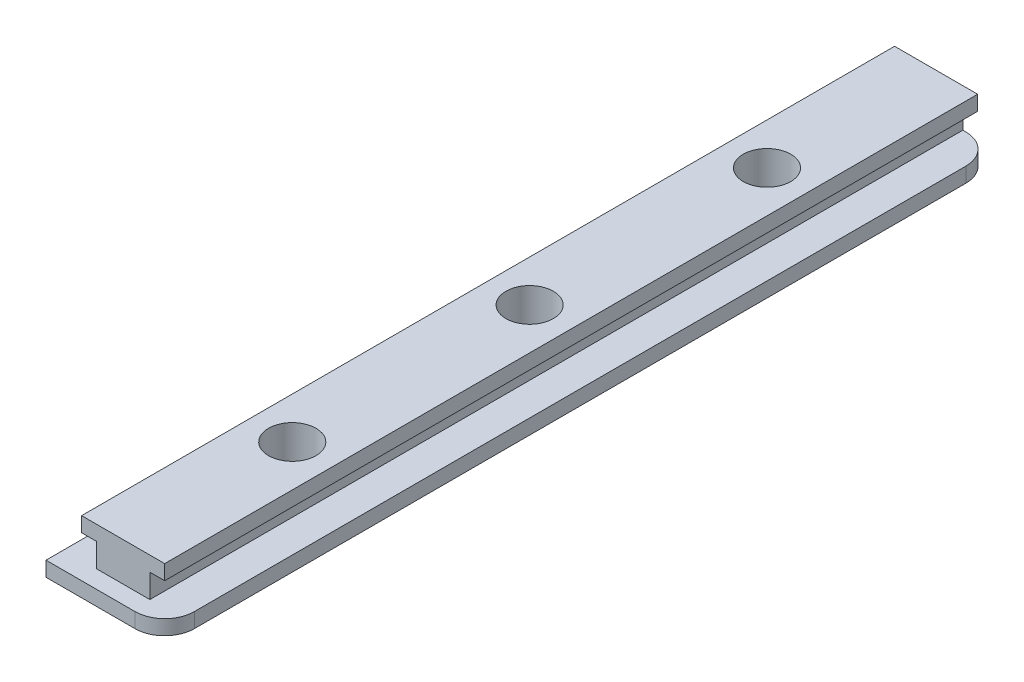
ISO-10303-21;
HEADER;
FILE_DESCRIPTION(('STEP AP214'),'2;1');
FILE_NAME('part.step','',(''),(''),'','','');
FILE_SCHEMA(('AUTOMOTIVE_DESIGN { 1 0 10303 214 1 1 1 1 }'));
ENDSEC;
DATA;
#1=APPLICATION_CONTEXT('core data for automotive mechanical design processes');
#2=APPLICATION_PROTOCOL_DEFINITION('international standard','automotive_design',2000,#1);
#3=PRODUCT_CONTEXT('',#1,'mechanical');
#4=PRODUCT('Part','Part','',(#3));
#5=PRODUCT_RELATED_PRODUCT_CATEGORY('part','',(#4));
#6=PRODUCT_DEFINITION_FORMATION('','',#4);
#7=PRODUCT_DEFINITION_CONTEXT('part definition',#1,'design');
#8=PRODUCT_DEFINITION('design','',#6,#7);
#9=PRODUCT_DEFINITION_SHAPE('','',#8);
#10=(LENGTH_UNIT() NAMED_UNIT(*) SI_UNIT(.MILLI.,.METRE.));
#11=(NAMED_UNIT(*) PLANE_ANGLE_UNIT() SI_UNIT($,.RADIAN.));
#12=(NAMED_UNIT(*) SI_UNIT($,.STERADIAN.) SOLID_ANGLE_UNIT());
#13=UNCERTAINTY_MEASURE_WITH_UNIT(LENGTH_MEASURE(1.E-05),#10,'distance_accuracy_value','');
#14=(GEOMETRIC_REPRESENTATION_CONTEXT(3) GLOBAL_UNCERTAINTY_ASSIGNED_CONTEXT((#13)) GLOBAL_UNIT_ASSIGNED_CONTEXT((#10,
#11,#12)) REPRESENTATION_CONTEXT('',''));
#15=CARTESIAN_POINT('',(0.,0.,0.));
#16=DIRECTION('',(0.,0.,1.));
#17=DIRECTION('',(1.,0.,0.));
#18=AXIS2_PLACEMENT_3D('',#15,#16,#17);
#19=CARTESIAN_POINT('',(-10.,-2.,68.5));
#20=DIRECTION('',(1.,0.,0.));
#21=DIRECTION('',(0.,1.,0.));
#22=AXIS2_PLACEMENT_3D('',#19,#20,#21);
#23=PLANE('',#22);
#24=DIRECTION('',(0.,-1.,0.));
#25=VECTOR('',#24,1.);
#26=CARTESIAN_POINT('',(-10.,-2.,-68.5));
#27=LINE('',#26,#25);
#28=CARTESIAN_POINT('',(-10.,-2.,-68.5));
#29=VERTEX_POINT('',#28);
#30=CARTESIAN_POINT('',(-10.,-4.5,-68.5));
#31=VERTEX_POINT('',#30);
#32=EDGE_CURVE('E142',#29,#31,#27,.T.);
#33=ORIENTED_EDGE('',*,*,#32,.T.);
#34=DIRECTION('',(0.,0.,-1.));
#35=VECTOR('',#34,1.);
#36=CARTESIAN_POINT('',(-10.,-4.5,68.5));
#37=LINE('',#36,#35);
#38=CARTESIAN_POINT('',(-10.,-4.49999999999999,71.5));
#39=VERTEX_POINT('',#38);
#40=EDGE_CURVE('E137',#39,#31,#37,.T.);
#41=ORIENTED_EDGE('',*,*,#40,.F.);
#42=DIRECTION('',(0.,-1.,0.));
#43=VECTOR('',#42,1.);
#44=CARTESIAN_POINT('',(-10.,-2.,71.5));
#45=LINE('',#44,#43);
#46=CARTESIAN_POINT('',(-10.,-2.,71.5));
#47=VERTEX_POINT('',#46);
#48=EDGE_CURVE('E140',#47,#39,#45,.T.);
#49=ORIENTED_EDGE('',*,*,#48,.F.);
#50=DIRECTION('',(0.,0.,-1.));
#51=VECTOR('',#50,1.);
#52=CARTESIAN_POINT('',(-10.,-2.,68.5));
#53=LINE('',#52,#51);
#54=EDGE_CURVE('E205',#47,#29,#53,.T.);
#55=ORIENTED_EDGE('',*,*,#54,.T.);
#56=EDGE_LOOP('',(#33,#41,#49,#55));
#57=FACE_BOUND('',#56,.T.);
#58=ADVANCED_FACE('F32',(#57),#23,.F.);
#59=CARTESIAN_POINT('',(-10.,-4.5,68.5));
#60=DIRECTION('',(0.,1.,0.));
#61=DIRECTION('',(-1.,0.,0.));
#62=AXIS2_PLACEMENT_3D('',#59,#60,#61);
#63=PLANE('',#62);
#64=CARTESIAN_POINT('',(0.,-4.5,-40.));
#65=DIRECTION('',(0.,1.,0.));
#66=DIRECTION('',(-1.,0.,0.));
#67=AXIS2_PLACEMENT_3D('',#64,#65,#66);
#68=CIRCLE('',#67,2.5);
#69=CARTESIAN_POINT('',(-2.5,-4.5,-40.));
#70=VERTEX_POINT('',#69);
#71=EDGE_CURVE('E184',#70,#70,#68,.T.);
#72=ORIENTED_EDGE('',*,*,#71,.T.);
#73=EDGE_LOOP('',(#72));
#74=FACE_BOUND('',#73,.T.);
#75=CARTESIAN_POINT('',(0.,-4.5,0.));
#76=DIRECTION('',(0.,1.,0.));
#77=DIRECTION('',(-1.,0.,0.));
#78=AXIS2_PLACEMENT_3D('',#75,#76,#77);
#79=CIRCLE('',#78,2.5);
#80=CARTESIAN_POINT('',(-2.5,-4.5,0.));
#81=VERTEX_POINT('',#80);
#82=EDGE_CURVE('E258',#81,#81,#79,.T.);
#83=ORIENTED_EDGE('',*,*,#82,.T.);
#84=EDGE_LOOP('',(#83));
#85=FACE_BOUND('',#84,.T.);
#86=CARTESIAN_POINT('',(0.,-4.5,40.));
#87=DIRECTION('',(0.,1.,0.));
#88=DIRECTION('',(-1.,0.,0.));
#89=AXIS2_PLACEMENT_3D('',#86,#87,#88);
#90=CIRCLE('',#89,2.5);
#91=CARTESIAN_POINT('',(-2.5,-4.5,40.));
#92=VERTEX_POINT('',#91);
#93=EDGE_CURVE('E165',#92,#92,#90,.T.);
#94=ORIENTED_EDGE('',*,*,#93,.T.);
#95=EDGE_LOOP('',(#94));
#96=FACE_BOUND('',#95,.T.);
#97=DIRECTION('',(1.,0.,0.));
#98=VECTOR('',#97,1.);
#99=CARTESIAN_POINT('',(-10.,-4.5,-68.5));
#100=LINE('',#99,#98);
#101=CARTESIAN_POINT('',(5.,-4.49999999999999,-68.5));
#102=VERTEX_POINT('',#101);
#103=EDGE_CURVE('E207',#31,#102,#100,.T.);
#104=ORIENTED_EDGE('',*,*,#103,.T.);
#105=CARTESIAN_POINT('',(5.,-4.49999999999999,-63.5));
#106=DIRECTION('',(0.,1.,0.));
#107=DIRECTION('',(-1.,0.,0.));
#108=AXIS2_PLACEMENT_3D('',#105,#106,#107);
#109=CIRCLE('',#108,5.);
#110=CARTESIAN_POINT('',(10.,-4.49999999999999,-63.5));
#111=VERTEX_POINT('',#110);
#112=EDGE_CURVE('E40',#102,#111,#109,.F.);
#113=ORIENTED_EDGE('',*,*,#112,.T.);
#114=DIRECTION('',(0.,0.,-1.));
#115=VECTOR('',#114,1.);
#116=CARTESIAN_POINT('',(10.,-4.49999999999999,68.5));
#117=LINE('',#116,#115);
#118=CARTESIAN_POINT('',(10.,-4.49999999999999,66.5));
#119=VERTEX_POINT('',#118);
#120=EDGE_CURVE('E144',#119,#111,#117,.T.);
#121=ORIENTED_EDGE('',*,*,#120,.F.);
#122=CARTESIAN_POINT('',(5.,-4.49999999999999,66.5));
#123=DIRECTION('',(0.,1.,0.));
#124=DIRECTION('',(-1.,0.,0.));
#125=AXIS2_PLACEMENT_3D('',#122,#123,#124);
#126=CIRCLE('',#125,5.);
#127=CARTESIAN_POINT('',(5.,-4.49999999999999,71.5));
#128=VERTEX_POINT('',#127);
#129=EDGE_CURVE('E47',#119,#128,#126,.F.);
#130=ORIENTED_EDGE('',*,*,#129,.T.);
#131=DIRECTION('',(1.,0.,0.));
#132=VECTOR('',#131,1.);
#133=CARTESIAN_POINT('',(-10.,-4.49999999999999,71.5));
#134=LINE('',#133,#132);
#135=EDGE_CURVE('E146',#39,#128,#134,.T.);
#136=ORIENTED_EDGE('',*,*,#135,.F.);
#137=ORIENTED_EDGE('',*,*,#40,.T.);
#138=EDGE_LOOP('',(#104,#113,#121,#130,#136,#137));
#139=FACE_BOUND('',#138,.T.);
#140=ADVANCED_FACE('F147',(#74,#85,#96,#139),#63,.F.);
#141=CARTESIAN_POINT('',(10.,-2.,68.5));
#142=DIRECTION('',(-1.,0.,0.));
#143=DIRECTION('',(0.,-1.,0.));
#144=AXIS2_PLACEMENT_3D('',#141,#142,#143);
#145=PLANE('',#144);
#146=ORIENTED_EDGE('',*,*,#120,.T.);
#147=DIRECTION('',(0.,1.,0.));
#148=VECTOR('',#147,1.);
#149=CARTESIAN_POINT('',(10.,-2.,-63.5));
#150=LINE('',#149,#148);
#151=CARTESIAN_POINT('',(10.,-2.,-63.5));
#152=VERTEX_POINT('',#151);
#153=EDGE_CURVE('E264',#111,#152,#150,.T.);
#154=ORIENTED_EDGE('',*,*,#153,.T.);
#155=DIRECTION('',(0.,0.,-1.));
#156=VECTOR('',#155,1.);
#157=CARTESIAN_POINT('',(10.,-2.,68.5));
#158=LINE('',#157,#156);
#159=CARTESIAN_POINT('',(10.,-2.,66.5));
#160=VERTEX_POINT('',#159);
#161=EDGE_CURVE('E251',#160,#152,#158,.T.);
#162=ORIENTED_EDGE('',*,*,#161,.F.);
#163=DIRECTION('',(0.,1.,0.));
#164=VECTOR('',#163,1.);
#165=CARTESIAN_POINT('',(10.,-4.49999999999999,66.5));
#166=LINE('',#165,#164);
#167=EDGE_CURVE('E161',#160,#119,#166,.F.);
#168=ORIENTED_EDGE('',*,*,#167,.T.);
#169=EDGE_LOOP('',(#146,#154,#162,#168));
#170=FACE_BOUND('',#169,.T.);
#171=ADVANCED_FACE('F276',(#170),#145,.F.);
#172=CARTESIAN_POINT('',(4.5,-2.,68.5));
#173=DIRECTION('',(-1.,0.,0.));
#174=DIRECTION('',(0.,-1.,0.));
#175=AXIS2_PLACEMENT_3D('',#172,#173,#174);
#176=PLANE('',#175);
#177=DIRECTION('',(0.,1.,0.));
#178=VECTOR('',#177,1.);
#179=CARTESIAN_POINT('',(4.5,-2.,-68.5));
#180=LINE('',#179,#178);
#181=CARTESIAN_POINT('',(4.5,-2.,-68.5));
#182=VERTEX_POINT('',#181);
#183=CARTESIAN_POINT('',(4.5,2.,-68.5));
#184=VERTEX_POINT('',#183);
#185=EDGE_CURVE('E211',#182,#184,#180,.T.);
#186=ORIENTED_EDGE('',*,*,#185,.T.);
#187=DIRECTION('',(0.,0.,-1.));
#188=VECTOR('',#187,1.);
#189=CARTESIAN_POINT('',(4.5,2.,68.5));
#190=LINE('',#189,#188);
#191=CARTESIAN_POINT('',(4.5,2.,68.5));
#192=VERTEX_POINT('',#191);
#193=EDGE_CURVE('E245',#192,#184,#190,.T.);
#194=ORIENTED_EDGE('',*,*,#193,.F.);
#195=DIRECTION('',(0.,1.,0.));
#196=VECTOR('',#195,1.);
#197=CARTESIAN_POINT('',(4.5,-2.,68.5));
#198=LINE('',#197,#196);
#199=CARTESIAN_POINT('',(4.5,-2.,68.5));
#200=VERTEX_POINT('',#199);
#201=EDGE_CURVE('E190',#200,#192,#198,.T.);
#202=ORIENTED_EDGE('',*,*,#201,.F.);
#203=DIRECTION('',(0.,0.,-1.));
#204=VECTOR('',#203,1.);
#205=CARTESIAN_POINT('',(4.5,-2.,68.5));
#206=LINE('',#205,#204);
#207=EDGE_CURVE('E248',#200,#182,#206,.T.);
#208=ORIENTED_EDGE('',*,*,#207,.T.);
#209=EDGE_LOOP('',(#186,#194,#202,#208));
#210=FACE_BOUND('',#209,.T.);
#211=ADVANCED_FACE('F289',(#210),#176,.F.);
#212=CARTESIAN_POINT('',(4.5,2.,68.5));
#213=DIRECTION('',(0.,1.,0.));
#214=DIRECTION('',(0.,0.,1.));
#215=AXIS2_PLACEMENT_3D('',#212,#213,#214);
#216=PLANE('',#215);
#217=DIRECTION('',(1.,0.,0.));
#218=VECTOR('',#217,1.);
#219=CARTESIAN_POINT('',(4.5,2.,-68.5));
#220=LINE('',#219,#218);
#221=CARTESIAN_POINT('',(7.,2.,-68.5));
#222=VERTEX_POINT('',#221);
#223=EDGE_CURVE('E213',#184,#222,#220,.T.);
#224=ORIENTED_EDGE('',*,*,#223,.T.);
#225=DIRECTION('',(0.,0.,-1.));
#226=VECTOR('',#225,1.);
#227=CARTESIAN_POINT('',(7.,2.,68.5));
#228=LINE('',#227,#226);
#229=CARTESIAN_POINT('',(7.,2.,68.5));
#230=VERTEX_POINT('',#229);
#231=EDGE_CURVE('E242',#230,#222,#228,.T.);
#232=ORIENTED_EDGE('',*,*,#231,.F.);
#233=DIRECTION('',(1.,0.,0.));
#234=VECTOR('',#233,1.);
#235=CARTESIAN_POINT('',(4.5,2.,68.5));
#236=LINE('',#235,#234);
#237=EDGE_CURVE('E192',#192,#230,#236,.T.);
#238=ORIENTED_EDGE('',*,*,#237,.F.);
#239=ORIENTED_EDGE('',*,*,#193,.T.);
#240=EDGE_LOOP('',(#224,#232,#238,#239));
#241=FACE_BOUND('',#240,.T.);
#242=ADVANCED_FACE('F293',(#241),#216,.F.);
#243=CARTESIAN_POINT('',(7.,4.5,68.5));
#244=DIRECTION('',(-1.,0.,0.));
#245=DIRECTION('',(0.,-1.,0.));
#246=AXIS2_PLACEMENT_3D('',#243,#244,#245);
#247=PLANE('',#246);
#248=DIRECTION('',(0.,1.,0.));
#249=VECTOR('',#248,1.);
#250=CARTESIAN_POINT('',(7.,4.5,-68.5));
#251=LINE('',#250,#249);
#252=CARTESIAN_POINT('',(7.,4.5,-68.5));
#253=VERTEX_POINT('',#252);
#254=EDGE_CURVE('E215',#222,#253,#251,.T.);
#255=ORIENTED_EDGE('',*,*,#254,.T.);
#256=DIRECTION('',(0.,0.,-1.));
#257=VECTOR('',#256,1.);
#258=CARTESIAN_POINT('',(7.,4.5,68.5));
#259=LINE('',#258,#257);
#260=CARTESIAN_POINT('',(7.,4.5,68.5));
#261=VERTEX_POINT('',#260);
#262=EDGE_CURVE('E239',#261,#253,#259,.T.);
#263=ORIENTED_EDGE('',*,*,#262,.F.);
#264=DIRECTION('',(0.,1.,0.));
#265=VECTOR('',#264,1.);
#266=CARTESIAN_POINT('',(7.,4.5,68.5));
#267=LINE('',#266,#265);
#268=EDGE_CURVE('E195',#230,#261,#267,.T.);
#269=ORIENTED_EDGE('',*,*,#268,.F.);
#270=ORIENTED_EDGE('',*,*,#231,.T.);
#271=EDGE_LOOP('',(#255,#263,#269,#270));
#272=FACE_BOUND('',#271,.T.);
#273=ADVANCED_FACE('F321',(#272),#247,.F.);
#274=CARTESIAN_POINT('',(-7.,4.49999999999999,68.5));
#275=DIRECTION('',(0.,-1.,0.));
#276=DIRECTION('',(1.,0.,0.));
#277=AXIS2_PLACEMENT_3D('',#274,#275,#276);
#278=PLANE('',#277);
#279=CARTESIAN_POINT('',(0.,4.5,40.));
#280=DIRECTION('',(0.,1.,0.));
#281=DIRECTION('',(0.,0.,1.));
#282=AXIS2_PLACEMENT_3D('',#279,#280,#281);
#283=CIRCLE('',#282,4.);
#284=CARTESIAN_POINT('',(0.,4.5,44.));
#285=VERTEX_POINT('',#284);
#286=EDGE_CURVE('E181',#285,#285,#283,.T.);
#287=ORIENTED_EDGE('',*,*,#286,.F.);
#288=EDGE_LOOP('',(#287));
#289=FACE_BOUND('',#288,.T.);
#290=CARTESIAN_POINT('',(0.,4.5,-40.));
#291=DIRECTION('',(0.,1.,0.));
#292=DIRECTION('',(0.,0.,1.));
#293=AXIS2_PLACEMENT_3D('',#290,#291,#292);
#294=CIRCLE('',#293,4.);
#295=CARTESIAN_POINT('',(0.,4.5,-36.));
#296=VERTEX_POINT('',#295);
#297=EDGE_CURVE('E175',#296,#296,#294,.T.);
#298=ORIENTED_EDGE('',*,*,#297,.F.);
#299=EDGE_LOOP('',(#298));
#300=FACE_BOUND('',#299,.T.);
#301=CARTESIAN_POINT('',(0.,4.5,0.));
#302=DIRECTION('',(0.,1.,0.));
#303=DIRECTION('',(0.,0.,1.));
#304=AXIS2_PLACEMENT_3D('',#301,#302,#303);
#305=CIRCLE('',#304,4.);
#306=CARTESIAN_POINT('',(0.,4.5,4.));
#307=VERTEX_POINT('',#306);
#308=EDGE_CURVE('E174',#307,#307,#305,.T.);
#309=ORIENTED_EDGE('',*,*,#308,.F.);
#310=EDGE_LOOP('',(#309));
#311=FACE_BOUND('',#310,.T.);
#312=DIRECTION('',(-1.,0.,0.));
#313=VECTOR('',#312,1.);
#314=CARTESIAN_POINT('',(-7.,4.49999999999999,-68.5));
#315=LINE('',#314,#313);
#316=CARTESIAN_POINT('',(-7.,4.49999999999999,-68.5));
#317=VERTEX_POINT('',#316);
#318=EDGE_CURVE('E217',#253,#317,#315,.T.);
#319=ORIENTED_EDGE('',*,*,#318,.T.);
#320=DIRECTION('',(0.,0.,-1.));
#321=VECTOR('',#320,1.);
#322=CARTESIAN_POINT('',(-7.,4.49999999999999,68.5));
#323=LINE('',#322,#321);
#324=CARTESIAN_POINT('',(-7.,4.49999999999999,68.5));
#325=VERTEX_POINT('',#324);
#326=EDGE_CURVE('E236',#325,#317,#323,.T.);
#327=ORIENTED_EDGE('',*,*,#326,.F.);
#328=DIRECTION('',(-1.,0.,0.));
#329=VECTOR('',#328,1.);
#330=CARTESIAN_POINT('',(-7.,4.49999999999999,68.5));
#331=LINE('',#330,#329);
#332=EDGE_CURVE('E197',#261,#325,#331,.T.);
#333=ORIENTED_EDGE('',*,*,#332,.F.);
#334=ORIENTED_EDGE('',*,*,#262,.T.);
#335=EDGE_LOOP('',(#319,#327,#333,#334));
#336=FACE_BOUND('',#335,.T.);
#337=ADVANCED_FACE('F318',(#289,#300,#311,#336),#278,.F.);
#338=CARTESIAN_POINT('',(-7.,4.49999999999999,68.5));
#339=DIRECTION('',(1.,0.,0.));
#340=DIRECTION('',(0.,1.,0.));
#341=AXIS2_PLACEMENT_3D('',#338,#339,#340);
#342=PLANE('',#341);
#343=DIRECTION('',(0.,-1.,0.));
#344=VECTOR('',#343,1.);
#345=CARTESIAN_POINT('',(-7.,4.49999999999999,-68.5));
#346=LINE('',#345,#344);
#347=CARTESIAN_POINT('',(-7.,1.99999999999999,-68.5));
#348=VERTEX_POINT('',#347);
#349=EDGE_CURVE('E219',#317,#348,#346,.T.);
#350=ORIENTED_EDGE('',*,*,#349,.T.);
#351=DIRECTION('',(0.,0.,-1.));
#352=VECTOR('',#351,1.);
#353=CARTESIAN_POINT('',(-7.,1.99999999999999,68.5));
#354=LINE('',#353,#352);
#355=CARTESIAN_POINT('',(-7.,1.99999999999999,68.5));
#356=VERTEX_POINT('',#355);
#357=EDGE_CURVE('E233',#356,#348,#354,.T.);
#358=ORIENTED_EDGE('',*,*,#357,.F.);
#359=DIRECTION('',(0.,-1.,0.));
#360=VECTOR('',#359,1.);
#361=CARTESIAN_POINT('',(-7.,4.49999999999999,68.5));
#362=LINE('',#361,#360);
#363=EDGE_CURVE('E199',#325,#356,#362,.T.);
#364=ORIENTED_EDGE('',*,*,#363,.F.);
#365=ORIENTED_EDGE('',*,*,#326,.T.);
#366=EDGE_LOOP('',(#350,#358,#364,#365));
#367=FACE_BOUND('',#366,.T.);
#368=ADVANCED_FACE('F314',(#367),#342,.F.);
#369=CARTESIAN_POINT('',(-4.5,1.99999999999999,68.5));
#370=DIRECTION('',(0.,1.,0.));
#371=DIRECTION('',(-1.,0.,0.));
#372=AXIS2_PLACEMENT_3D('',#369,#370,#371);
#373=PLANE('',#372);
#374=DIRECTION('',(1.,0.,0.));
#375=VECTOR('',#374,1.);
#376=CARTESIAN_POINT('',(-4.5,1.99999999999999,-68.5));
#377=LINE('',#376,#375);
#378=CARTESIAN_POINT('',(-4.5,1.99999999999999,-68.5));
#379=VERTEX_POINT('',#378);
#380=EDGE_CURVE('E221',#348,#379,#377,.T.);
#381=ORIENTED_EDGE('',*,*,#380,.T.);
#382=DIRECTION('',(0.,0.,-1.));
#383=VECTOR('',#382,1.);
#384=CARTESIAN_POINT('',(-4.5,1.99999999999999,68.5));
#385=LINE('',#384,#383);
#386=CARTESIAN_POINT('',(-4.5,1.99999999999999,68.5));
#387=VERTEX_POINT('',#386);
#388=EDGE_CURVE('E230',#387,#379,#385,.T.);
#389=ORIENTED_EDGE('',*,*,#388,.F.);
#390=DIRECTION('',(1.,0.,0.));
#391=VECTOR('',#390,1.);
#392=CARTESIAN_POINT('',(-4.5,1.99999999999999,68.5));
#393=LINE('',#392,#391);
#394=EDGE_CURVE('E201',#356,#387,#393,.T.);
#395=ORIENTED_EDGE('',*,*,#394,.F.);
#396=ORIENTED_EDGE('',*,*,#357,.T.);
#397=EDGE_LOOP('',(#381,#389,#395,#396));
#398=FACE_BOUND('',#397,.T.);
#399=ADVANCED_FACE('F310',(#398),#373,.F.);
#400=CARTESIAN_POINT('',(-4.5,-2.,68.5));
#401=DIRECTION('',(1.,0.,0.));
#402=DIRECTION('',(0.,0.,-1.));
#403=AXIS2_PLACEMENT_3D('',#400,#401,#402);
#404=PLANE('',#403);
#405=DIRECTION('',(0.,-1.,0.));
#406=VECTOR('',#405,1.);
#407=CARTESIAN_POINT('',(-4.5,-2.,-68.5));
#408=LINE('',#407,#406);
#409=CARTESIAN_POINT('',(-4.5,-2.,-68.5));
#410=VERTEX_POINT('',#409);
#411=EDGE_CURVE('E223',#379,#410,#408,.T.);
#412=ORIENTED_EDGE('',*,*,#411,.T.);
#413=DIRECTION('',(0.,0.,-1.));
#414=VECTOR('',#413,1.);
#415=CARTESIAN_POINT('',(-4.5,-2.,68.5));
#416=LINE('',#415,#414);
#417=CARTESIAN_POINT('',(-4.5,-2.,68.5));
#418=VERTEX_POINT('',#417);
#419=EDGE_CURVE('E227',#418,#410,#416,.T.);
#420=ORIENTED_EDGE('',*,*,#419,.F.);
#421=DIRECTION('',(0.,-1.,0.));
#422=VECTOR('',#421,1.);
#423=CARTESIAN_POINT('',(-4.5,-2.,68.5));
#424=LINE('',#423,#422);
#425=EDGE_CURVE('E203',#387,#418,#424,.T.);
#426=ORIENTED_EDGE('',*,*,#425,.F.);
#427=ORIENTED_EDGE('',*,*,#388,.T.);
#428=EDGE_LOOP('',(#412,#420,#426,#427));
#429=FACE_BOUND('',#428,.T.);
#430=ADVANCED_FACE('F306',(#429),#404,.F.);
#431=CARTESIAN_POINT('',(-10.,-2.,68.5));
#432=DIRECTION('',(0.,-1.,0.));
#433=DIRECTION('',(0.,0.,-1.));
#434=AXIS2_PLACEMENT_3D('',#431,#432,#433);
#435=PLANE('',#434);
#436=ORIENTED_EDGE('',*,*,#161,.T.);
#437=CARTESIAN_POINT('',(5.,-2.,-63.5));
#438=DIRECTION('',(0.,-1.,0.));
#439=DIRECTION('',(0.,0.,-1.));
#440=AXIS2_PLACEMENT_3D('',#437,#438,#439);
#441=CIRCLE('',#440,5.);
#442=CARTESIAN_POINT('',(5.,-2.,-68.5));
#443=VERTEX_POINT('',#442);
#444=EDGE_CURVE('E269',#152,#443,#441,.F.);
#445=ORIENTED_EDGE('',*,*,#444,.T.);
#446=DIRECTION('',(-1.,0.,0.));
#447=VECTOR('',#446,1.);
#448=CARTESIAN_POINT('',(10.,-2.,-68.5));
#449=LINE('',#448,#447);
#450=EDGE_CURVE('E209',#443,#182,#449,.T.);
#451=ORIENTED_EDGE('',*,*,#450,.T.);
#452=ORIENTED_EDGE('',*,*,#207,.F.);
#453=DIRECTION('',(-1.,0.,0.));
#454=VECTOR('',#453,1.);
#455=CARTESIAN_POINT('',(-10.,-2.,68.5));
#456=LINE('',#455,#454);
#457=EDGE_CURVE('E143',#200,#418,#456,.T.);
#458=ORIENTED_EDGE('',*,*,#457,.T.);
#459=ORIENTED_EDGE('',*,*,#419,.T.);
#460=DIRECTION('',(-1.,0.,0.));
#461=VECTOR('',#460,1.);
#462=CARTESIAN_POINT('',(-10.,-2.,-68.5));
#463=LINE('',#462,#461);
#464=EDGE_CURVE('E193',#410,#29,#463,.T.);
#465=ORIENTED_EDGE('',*,*,#464,.T.);
#466=ORIENTED_EDGE('',*,*,#54,.F.);
#467=DIRECTION('',(-1.,0.,0.));
#468=VECTOR('',#467,1.);
#469=CARTESIAN_POINT('',(-10.,-2.,71.5));
#470=LINE('',#469,#468);
#471=CARTESIAN_POINT('',(5.,-2.,71.5));
#472=VERTEX_POINT('',#471);
#473=EDGE_CURVE('E150',#472,#47,#470,.T.);
#474=ORIENTED_EDGE('',*,*,#473,.F.);
#475=CARTESIAN_POINT('',(5.,-2.,66.5));
#476=DIRECTION('',(0.,-1.,0.));
#477=DIRECTION('',(0.,0.,-1.));
#478=AXIS2_PLACEMENT_3D('',#475,#476,#477);
#479=CIRCLE('',#478,5.);
#480=EDGE_CURVE('E267',#472,#160,#479,.F.);
#481=ORIENTED_EDGE('',*,*,#480,.T.);
#482=EDGE_LOOP('',(#436,#445,#451,#452,#458,#459,#465,#466,#474,#481));
#483=FACE_BOUND('',#482,.T.);
#484=ADVANCED_FACE('F281',(#483),#435,.F.);
#485=CARTESIAN_POINT('',(0.,0.,68.5));
#486=DIRECTION('',(0.,0.,1.));
#487=DIRECTION('',(1.,0.,0.));
#488=AXIS2_PLACEMENT_3D('',#485,#486,#487);
#489=PLANE('',#488);
#490=ORIENTED_EDGE('',*,*,#457,.F.);
#491=ORIENTED_EDGE('',*,*,#201,.T.);
#492=ORIENTED_EDGE('',*,*,#237,.T.);
#493=ORIENTED_EDGE('',*,*,#268,.T.);
#494=ORIENTED_EDGE('',*,*,#332,.T.);
#495=ORIENTED_EDGE('',*,*,#363,.T.);
#496=ORIENTED_EDGE('',*,*,#394,.T.);
#497=ORIENTED_EDGE('',*,*,#425,.T.);
#498=EDGE_LOOP('',(#490,#491,#492,#493,#494,#495,#496,#497));
#499=FACE_BOUND('',#498,.T.);
#500=ADVANCED_FACE('F297',(#499),#489,.T.);
#501=CARTESIAN_POINT('',(0.,0.,-68.5));
#502=DIRECTION('',(0.,0.,1.));
#503=DIRECTION('',(1.,0.,0.));
#504=AXIS2_PLACEMENT_3D('',#501,#502,#503);
#505=PLANE('',#504);
#506=ORIENTED_EDGE('',*,*,#450,.F.);
#507=DIRECTION('',(0.,1.,0.));
#508=VECTOR('',#507,1.);
#509=CARTESIAN_POINT('',(5.,0.,-68.5));
#510=LINE('',#509,#508);
#511=EDGE_CURVE('E55',#443,#102,#510,.F.);
#512=ORIENTED_EDGE('',*,*,#511,.T.);
#513=ORIENTED_EDGE('',*,*,#103,.F.);
#514=ORIENTED_EDGE('',*,*,#32,.F.);
#515=ORIENTED_EDGE('',*,*,#464,.F.);
#516=ORIENTED_EDGE('',*,*,#411,.F.);
#517=ORIENTED_EDGE('',*,*,#380,.F.);
#518=ORIENTED_EDGE('',*,*,#349,.F.);
#519=ORIENTED_EDGE('',*,*,#318,.F.);
#520=ORIENTED_EDGE('',*,*,#254,.F.);
#521=ORIENTED_EDGE('',*,*,#223,.F.);
#522=ORIENTED_EDGE('',*,*,#185,.F.);
#523=EDGE_LOOP('',(#506,#512,#513,#514,#515,#516,#517,#518,#519,#520,#521,#522));
#524=FACE_BOUND('',#523,.T.);
#525=ADVANCED_FACE('F284',(#524),#505,.F.);
#526=CARTESIAN_POINT('',(0.,-1.5,0.));
#527=DIRECTION('',(0.,1.,0.));
#528=DIRECTION('',(0.,0.,1.));
#529=AXIS2_PLACEMENT_3D('',#526,#527,#528);
#530=CYLINDRICAL_SURFACE('',#529,4.);
#531=CARTESIAN_POINT('',(0.,-1.5,0.));
#532=DIRECTION('',(0.,1.,0.));
#533=DIRECTION('',(0.,0.,1.));
#534=AXIS2_PLACEMENT_3D('',#531,#532,#533);
#535=CIRCLE('',#534,4.);
#536=CARTESIAN_POINT('',(0.,-1.5,4.));
#537=VERTEX_POINT('',#536);
#538=EDGE_CURVE('E185',#537,#537,#535,.T.);
#539=ORIENTED_EDGE('',*,*,#538,.F.);
#540=EDGE_LOOP('',(#539));
#541=FACE_BOUND('',#540,.T.);
#542=ORIENTED_EDGE('',*,*,#308,.T.);
#543=EDGE_LOOP('',(#542));
#544=FACE_BOUND('',#543,.T.);
#545=ADVANCED_FACE('F380',(#541,#544),#530,.F.);
#546=CARTESIAN_POINT('',(0.,-1.5,0.));
#547=DIRECTION('',(0.,1.,0.));
#548=DIRECTION('',(0.,0.,1.));
#549=AXIS2_PLACEMENT_3D('',#546,#547,#548);
#550=PLANE('',#549);
#551=CARTESIAN_POINT('',(0.,-1.5,0.));
#552=DIRECTION('',(0.,1.,0.));
#553=DIRECTION('',(0.,0.,1.));
#554=AXIS2_PLACEMENT_3D('',#551,#552,#553);
#555=CIRCLE('',#554,2.5);
#556=CARTESIAN_POINT('',(0.,-1.5,2.5));
#557=VERTEX_POINT('',#556);
#558=EDGE_CURVE('E166',#557,#557,#555,.T.);
#559=ORIENTED_EDGE('',*,*,#558,.F.);
#560=EDGE_LOOP('',(#559));
#561=FACE_BOUND('',#560,.T.);
#562=ORIENTED_EDGE('',*,*,#538,.T.);
#563=EDGE_LOOP('',(#562));
#564=FACE_BOUND('',#563,.T.);
#565=ADVANCED_FACE('F370',(#561,#564),#550,.T.);
#566=CARTESIAN_POINT('',(0.,-1.5,-40.));
#567=DIRECTION('',(0.,1.,0.));
#568=DIRECTION('',(0.,0.,1.));
#569=AXIS2_PLACEMENT_3D('',#566,#567,#568);
#570=CYLINDRICAL_SURFACE('',#569,4.);
#571=CARTESIAN_POINT('',(0.,-1.5,-40.));
#572=DIRECTION('',(0.,1.,0.));
#573=DIRECTION('',(0.,0.,1.));
#574=AXIS2_PLACEMENT_3D('',#571,#572,#573);
#575=CIRCLE('',#574,4.);
#576=CARTESIAN_POINT('',(0.,-1.5,-36.));
#577=VERTEX_POINT('',#576);
#578=EDGE_CURVE('E171',#577,#577,#575,.T.);
#579=ORIENTED_EDGE('',*,*,#578,.F.);
#580=EDGE_LOOP('',(#579));
#581=FACE_BOUND('',#580,.T.);
#582=ORIENTED_EDGE('',*,*,#297,.T.);
#583=EDGE_LOOP('',(#582));
#584=FACE_BOUND('',#583,.T.);
#585=ADVANCED_FACE('F366',(#581,#584),#570,.F.);
#586=CARTESIAN_POINT('',(0.,-1.5,-40.));
#587=DIRECTION('',(0.,1.,0.));
#588=DIRECTION('',(0.,0.,1.));
#589=AXIS2_PLACEMENT_3D('',#586,#587,#588);
#590=PLANE('',#589);
#591=CARTESIAN_POINT('',(0.,-1.5,-40.));
#592=DIRECTION('',(0.,1.,0.));
#593=DIRECTION('',(0.,0.,1.));
#594=AXIS2_PLACEMENT_3D('',#591,#592,#593);
#595=CIRCLE('',#594,2.5);
#596=CARTESIAN_POINT('',(0.,-1.5,-37.5));
#597=VERTEX_POINT('',#596);
#598=EDGE_CURVE('E162',#597,#597,#595,.T.);
#599=ORIENTED_EDGE('',*,*,#598,.F.);
#600=EDGE_LOOP('',(#599));
#601=FACE_BOUND('',#600,.T.);
#602=ORIENTED_EDGE('',*,*,#578,.T.);
#603=EDGE_LOOP('',(#602));
#604=FACE_BOUND('',#603,.T.);
#605=ADVANCED_FACE('F362',(#601,#604),#590,.T.);
#606=CARTESIAN_POINT('',(0.,-1.5,40.));
#607=DIRECTION('',(0.,1.,0.));
#608=DIRECTION('',(0.,0.,1.));
#609=AXIS2_PLACEMENT_3D('',#606,#607,#608);
#610=CYLINDRICAL_SURFACE('',#609,4.);
#611=CARTESIAN_POINT('',(0.,-1.5,40.));
#612=DIRECTION('',(0.,1.,0.));
#613=DIRECTION('',(0.,0.,1.));
#614=AXIS2_PLACEMENT_3D('',#611,#612,#613);
#615=CIRCLE('',#614,4.);
#616=CARTESIAN_POINT('',(0.,-1.5,44.));
#617=VERTEX_POINT('',#616);
#618=EDGE_CURVE('E178',#617,#617,#615,.T.);
#619=ORIENTED_EDGE('',*,*,#618,.F.);
#620=EDGE_LOOP('',(#619));
#621=FACE_BOUND('',#620,.T.);
#622=ORIENTED_EDGE('',*,*,#286,.T.);
#623=EDGE_LOOP('',(#622));
#624=FACE_BOUND('',#623,.T.);
#625=ADVANCED_FACE('F365',(#621,#624),#610,.F.);
#626=CARTESIAN_POINT('',(0.,-1.5,40.));
#627=DIRECTION('',(0.,1.,0.));
#628=DIRECTION('',(0.,0.,1.));
#629=AXIS2_PLACEMENT_3D('',#626,#627,#628);
#630=PLANE('',#629);
#631=CARTESIAN_POINT('',(0.,-1.5,40.));
#632=DIRECTION('',(0.,1.,0.));
#633=DIRECTION('',(0.,0.,1.));
#634=AXIS2_PLACEMENT_3D('',#631,#632,#633);
#635=CIRCLE('',#634,2.5);
#636=CARTESIAN_POINT('',(0.,-1.5,42.5));
#637=VERTEX_POINT('',#636);
#638=EDGE_CURVE('E158',#637,#637,#635,.T.);
#639=ORIENTED_EDGE('',*,*,#638,.F.);
#640=EDGE_LOOP('',(#639));
#641=FACE_BOUND('',#640,.T.);
#642=ORIENTED_EDGE('',*,*,#618,.T.);
#643=EDGE_LOOP('',(#642));
#644=FACE_BOUND('',#643,.T.);
#645=ADVANCED_FACE('F360',(#641,#644),#630,.T.);
#646=CARTESIAN_POINT('',(0.,-5.50000000000001,40.));
#647=DIRECTION('',(0.,1.,0.));
#648=DIRECTION('',(0.,0.,1.));
#649=AXIS2_PLACEMENT_3D('',#646,#647,#648);
#650=CYLINDRICAL_SURFACE('',#649,2.5);
#651=ORIENTED_EDGE('',*,*,#638,.T.);
#652=EDGE_LOOP('',(#651));
#653=FACE_BOUND('',#652,.T.);
#654=ORIENTED_EDGE('',*,*,#93,.F.);
#655=EDGE_LOOP('',(#654));
#656=FACE_BOUND('',#655,.T.);
#657=ADVANCED_FACE('F356',(#653,#656),#650,.F.);
#658=CARTESIAN_POINT('',(0.,-5.50000000000001,0.));
#659=DIRECTION('',(0.,1.,0.));
#660=DIRECTION('',(0.,0.,1.));
#661=AXIS2_PLACEMENT_3D('',#658,#659,#660);
#662=CYLINDRICAL_SURFACE('',#661,2.5);
#663=ORIENTED_EDGE('',*,*,#558,.T.);
#664=EDGE_LOOP('',(#663));
#665=FACE_BOUND('',#664,.T.);
#666=ORIENTED_EDGE('',*,*,#82,.F.);
#667=EDGE_LOOP('',(#666));
#668=FACE_BOUND('',#667,.T.);
#669=ADVANCED_FACE('F350',(#665,#668),#662,.F.);
#670=CARTESIAN_POINT('',(0.,-5.50000000000001,-40.));
#671=DIRECTION('',(0.,1.,0.));
#672=DIRECTION('',(0.,0.,1.));
#673=AXIS2_PLACEMENT_3D('',#670,#671,#672);
#674=CYLINDRICAL_SURFACE('',#673,2.5);
#675=ORIENTED_EDGE('',*,*,#598,.T.);
#676=EDGE_LOOP('',(#675));
#677=FACE_BOUND('',#676,.T.);
#678=ORIENTED_EDGE('',*,*,#71,.F.);
#679=EDGE_LOOP('',(#678));
#680=FACE_BOUND('',#679,.T.);
#681=ADVANCED_FACE('F345',(#677,#680),#674,.F.);
#682=CARTESIAN_POINT('',(0.,0.,71.5));
#683=DIRECTION('',(0.,0.,1.));
#684=DIRECTION('',(1.,0.,0.));
#685=AXIS2_PLACEMENT_3D('',#682,#683,#684);
#686=PLANE('',#685);
#687=ORIENTED_EDGE('',*,*,#135,.T.);
#688=DIRECTION('',(0.,1.,0.));
#689=VECTOR('',#688,1.);
#690=CARTESIAN_POINT('',(5.,-2.,71.5));
#691=LINE('',#690,#689);
#692=EDGE_CURVE('E11',#128,#472,#691,.T.);
#693=ORIENTED_EDGE('',*,*,#692,.T.);
#694=ORIENTED_EDGE('',*,*,#473,.T.);
#695=ORIENTED_EDGE('',*,*,#48,.T.);
#696=EDGE_LOOP('',(#687,#693,#694,#695));
#697=FACE_BOUND('',#696,.T.);
#698=ADVANCED_FACE('F152',(#697),#686,.T.);
#699=CARTESIAN_POINT('',(5.,-2.,-63.5));
#700=DIRECTION('',(0.,1.,0.));
#701=DIRECTION('',(-1.,0.,0.));
#702=AXIS2_PLACEMENT_3D('',#699,#700,#701);
#703=CYLINDRICAL_SURFACE('',#702,5.);
#704=ORIENTED_EDGE('',*,*,#112,.F.);
#705=ORIENTED_EDGE('',*,*,#511,.F.);
#706=ORIENTED_EDGE('',*,*,#444,.F.);
#707=ORIENTED_EDGE('',*,*,#153,.F.);
#708=EDGE_LOOP('',(#704,#705,#706,#707));
#709=FACE_BOUND('',#708,.T.);
#710=ADVANCED_FACE('F279',(#709),#703,.T.);
#711=CARTESIAN_POINT('',(5.,0.,66.5));
#712=DIRECTION('',(0.,-1.,0.));
#713=DIRECTION('',(1.,0.,0.));
#714=AXIS2_PLACEMENT_3D('',#711,#712,#713);
#715=CYLINDRICAL_SURFACE('',#714,5.);
#716=ORIENTED_EDGE('',*,*,#129,.F.);
#717=ORIENTED_EDGE('',*,*,#167,.F.);
#718=ORIENTED_EDGE('',*,*,#480,.F.);
#719=ORIENTED_EDGE('',*,*,#692,.F.);
#720=EDGE_LOOP('',(#716,#717,#718,#719));
#721=FACE_BOUND('',#720,.T.);
#722=ADVANCED_FACE('F34',(#721),#715,.T.);
#723=CLOSED_SHELL('',(#58,#140,#171,#211,#242,#273,#337,#368,#399,#430,#484,#500,#525,#545,#565,
#585,#605,#625,#645,#657,#669,#681,#698,#710,#722));
#724=MANIFOLD_SOLID_BREP('B2',#723);
#725=ADVANCED_BREP_SHAPE_REPRESENTATION('',(#18,#724),#14);
#726=SHAPE_DEFINITION_REPRESENTATION(#9,#725);
ENDSEC;
END-ISO-10303-21;
